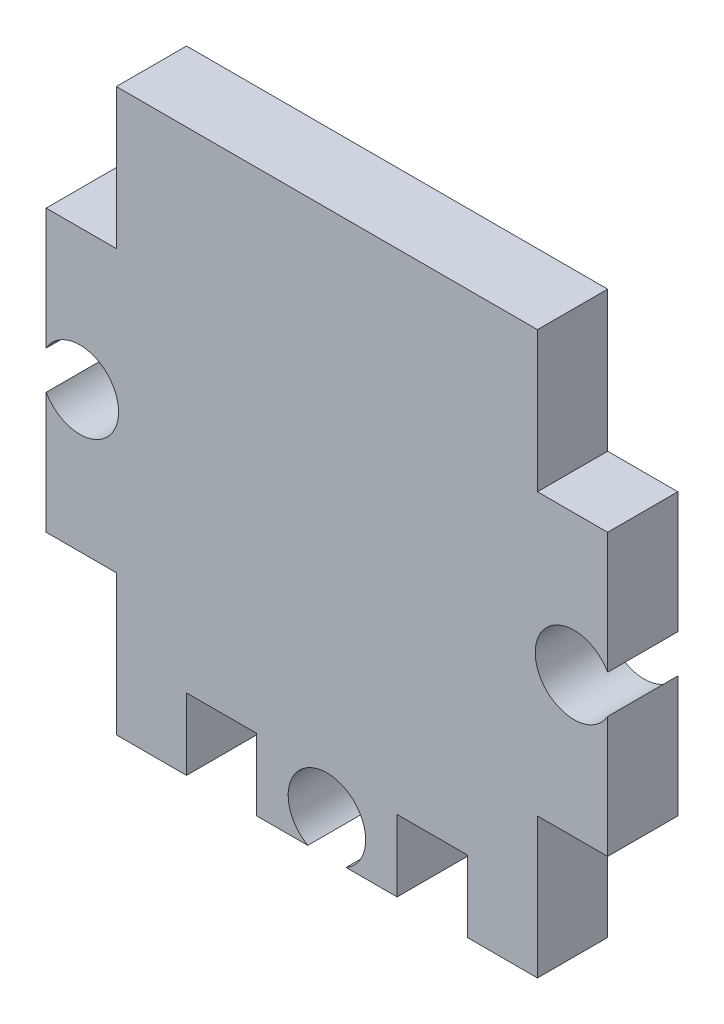
ISO-10303-21;
HEADER;
FILE_DESCRIPTION(('STEP AP214'),'2;1');
FILE_NAME('part.step','',(''),(''),'','','');
FILE_SCHEMA(('AUTOMOTIVE_DESIGN { 1 0 10303 214 1 1 1 1 }'));
ENDSEC;
DATA;
#1=APPLICATION_CONTEXT('core data for automotive mechanical design processes');
#2=APPLICATION_PROTOCOL_DEFINITION('international standard','automotive_design',2000,#1);
#3=PRODUCT_CONTEXT('',#1,'mechanical');
#4=PRODUCT('Part','Part','',(#3));
#5=PRODUCT_RELATED_PRODUCT_CATEGORY('part','',(#4));
#6=PRODUCT_DEFINITION_FORMATION('','',#4);
#7=PRODUCT_DEFINITION_CONTEXT('part definition',#1,'design');
#8=PRODUCT_DEFINITION('design','',#6,#7);
#9=PRODUCT_DEFINITION_SHAPE('','',#8);
#10=(LENGTH_UNIT() NAMED_UNIT(*) SI_UNIT(.MILLI.,.METRE.));
#11=(NAMED_UNIT(*) PLANE_ANGLE_UNIT() SI_UNIT($,.RADIAN.));
#12=(NAMED_UNIT(*) SI_UNIT($,.STERADIAN.) SOLID_ANGLE_UNIT());
#13=UNCERTAINTY_MEASURE_WITH_UNIT(LENGTH_MEASURE(1.E-05),#10,'distance_accuracy_value','');
#14=(GEOMETRIC_REPRESENTATION_CONTEXT(3) GLOBAL_UNCERTAINTY_ASSIGNED_CONTEXT((#13)) GLOBAL_UNIT_ASSIGNED_CONTEXT((#10,
#11,#12)) REPRESENTATION_CONTEXT('',''));
#15=CARTESIAN_POINT('',(0.,0.,0.));
#16=DIRECTION('',(0.,0.,1.));
#17=DIRECTION('',(1.,0.,0.));
#18=AXIS2_PLACEMENT_3D('',#15,#16,#17);
#19=CARTESIAN_POINT('',(-12.7,-6.35,3.175));
#20=DIRECTION('',(0.,1.,0.));
#21=DIRECTION('',(-1.,0.,0.));
#22=AXIS2_PLACEMENT_3D('',#19,#20,#21);
#23=PLANE('',#22);
#24=DIRECTION('',(1.,0.,0.));
#25=VECTOR('',#24,1.);
#26=CARTESIAN_POINT('',(-12.7,-6.35,0.));
#27=LINE('',#26,#25);
#28=CARTESIAN_POINT('',(-12.7,-6.35,0.));
#29=VERTEX_POINT('',#28);
#30=CARTESIAN_POINT('',(-9.525,-6.35,0.));
#31=VERTEX_POINT('',#30);
#32=EDGE_CURVE('E237',#29,#31,#27,.T.);
#33=ORIENTED_EDGE('',*,*,#32,.T.);
#34=DIRECTION('',(0.,0.,-1.));
#35=VECTOR('',#34,1.);
#36=CARTESIAN_POINT('',(-9.525,-6.35,3.175));
#37=LINE('',#36,#35);
#38=CARTESIAN_POINT('',(-9.525,-6.35,3.175));
#39=VERTEX_POINT('',#38);
#40=EDGE_CURVE('E11',#39,#31,#37,.T.);
#41=ORIENTED_EDGE('',*,*,#40,.F.);
#42=DIRECTION('',(1.,0.,0.));
#43=VECTOR('',#42,1.);
#44=CARTESIAN_POINT('',(-12.7,-6.35,3.175));
#45=LINE('',#44,#43);
#46=CARTESIAN_POINT('',(-12.7,-6.35,3.175));
#47=VERTEX_POINT('',#46);
#48=EDGE_CURVE('E287',#47,#39,#45,.T.);
#49=ORIENTED_EDGE('',*,*,#48,.F.);
#50=DIRECTION('',(0.,0.,-1.));
#51=VECTOR('',#50,1.);
#52=CARTESIAN_POINT('',(-12.7,-6.35,3.175));
#53=LINE('',#52,#51);
#54=EDGE_CURVE('E233',#47,#29,#53,.T.);
#55=ORIENTED_EDGE('',*,*,#54,.T.);
#56=EDGE_LOOP('',(#33,#41,#49,#55));
#57=FACE_BOUND('',#56,.T.);
#58=ADVANCED_FACE('F33',(#57),#23,.F.);
#59=CARTESIAN_POINT('',(-9.525,-6.35,3.175));
#60=DIRECTION('',(1.,0.,0.));
#61=DIRECTION('',(0.,0.,-1.));
#62=AXIS2_PLACEMENT_3D('',#59,#60,#61);
#63=PLANE('',#62);
#64=DIRECTION('',(0.,-1.,0.));
#65=VECTOR('',#64,1.);
#66=CARTESIAN_POINT('',(-9.525,-6.35,0.));
#67=LINE('',#66,#65);
#68=CARTESIAN_POINT('',(-9.525,-12.7,0.));
#69=VERTEX_POINT('',#68);
#70=EDGE_CURVE('E240',#31,#69,#67,.T.);
#71=ORIENTED_EDGE('',*,*,#70,.T.);
#72=DIRECTION('',(0.,0.,-1.));
#73=VECTOR('',#72,1.);
#74=CARTESIAN_POINT('',(-9.525,-12.7,3.175));
#75=LINE('',#74,#73);
#76=CARTESIAN_POINT('',(-9.525,-12.7,3.175));
#77=VERTEX_POINT('',#76);
#78=EDGE_CURVE('E41',#77,#69,#75,.T.);
#79=ORIENTED_EDGE('',*,*,#78,.F.);
#80=DIRECTION('',(0.,-1.,0.));
#81=VECTOR('',#80,1.);
#82=CARTESIAN_POINT('',(-9.525,-6.35,3.175));
#83=LINE('',#82,#81);
#84=EDGE_CURVE('E146',#39,#77,#83,.T.);
#85=ORIENTED_EDGE('',*,*,#84,.F.);
#86=ORIENTED_EDGE('',*,*,#40,.T.);
#87=EDGE_LOOP('',(#71,#79,#85,#86));
#88=FACE_BOUND('',#87,.T.);
#89=ADVANCED_FACE('F435',(#88),#63,.F.);
#90=CARTESIAN_POINT('',(-9.525,-12.7,3.175));
#91=DIRECTION('',(0.,1.,0.));
#92=DIRECTION('',(0.,0.,1.));
#93=AXIS2_PLACEMENT_3D('',#90,#91,#92);
#94=PLANE('',#93);
#95=DIRECTION('',(1.,0.,0.));
#96=VECTOR('',#95,1.);
#97=CARTESIAN_POINT('',(-9.525,-12.7,0.));
#98=LINE('',#97,#96);
#99=CARTESIAN_POINT('',(-6.35,-12.7,0.));
#100=VERTEX_POINT('',#99);
#101=EDGE_CURVE('E242',#69,#100,#98,.T.);
#102=ORIENTED_EDGE('',*,*,#101,.T.);
#103=DIRECTION('',(0.,0.,-1.));
#104=VECTOR('',#103,1.);
#105=CARTESIAN_POINT('',(-6.35,-12.7,3.175));
#106=LINE('',#105,#104);
#107=CARTESIAN_POINT('',(-6.35,-12.7,3.175));
#108=VERTEX_POINT('',#107);
#109=EDGE_CURVE('E348',#108,#100,#106,.T.);
#110=ORIENTED_EDGE('',*,*,#109,.F.);
#111=DIRECTION('',(1.,0.,0.));
#112=VECTOR('',#111,1.);
#113=CARTESIAN_POINT('',(-9.525,-12.7,3.175));
#114=LINE('',#113,#112);
#115=EDGE_CURVE('E356',#77,#108,#114,.T.);
#116=ORIENTED_EDGE('',*,*,#115,.F.);
#117=ORIENTED_EDGE('',*,*,#78,.T.);
#118=EDGE_LOOP('',(#102,#110,#116,#117));
#119=FACE_BOUND('',#118,.T.);
#120=ADVANCED_FACE('F354',(#119),#94,.F.);
#121=CARTESIAN_POINT('',(-6.35,-9.46709374294294,3.175));
#122=DIRECTION('',(-1.,0.,0.));
#123=DIRECTION('',(0.,0.,1.));
#124=AXIS2_PLACEMENT_3D('',#121,#122,#123);
#125=PLANE('',#124);
#126=DIRECTION('',(0.,1.,0.));
#127=VECTOR('',#126,1.);
#128=CARTESIAN_POINT('',(-6.35,-9.46709374294294,0.));
#129=LINE('',#128,#127);
#130=CARTESIAN_POINT('',(-6.35,-9.46709374294294,0.));
#131=VERTEX_POINT('',#130);
#132=EDGE_CURVE('E244',#100,#131,#129,.T.);
#133=ORIENTED_EDGE('',*,*,#132,.T.);
#134=DIRECTION('',(0.,0.,-1.));
#135=VECTOR('',#134,1.);
#136=CARTESIAN_POINT('',(-6.35,-9.46709374294294,3.175));
#137=LINE('',#136,#135);
#138=CARTESIAN_POINT('',(-6.35,-9.46709374294294,3.175));
#139=VERTEX_POINT('',#138);
#140=EDGE_CURVE('E345',#139,#131,#137,.T.);
#141=ORIENTED_EDGE('',*,*,#140,.F.);
#142=DIRECTION('',(0.,1.,0.));
#143=VECTOR('',#142,1.);
#144=CARTESIAN_POINT('',(-6.35,-9.46709374294294,3.175));
#145=LINE('',#144,#143);
#146=EDGE_CURVE('E374',#108,#139,#145,.T.);
#147=ORIENTED_EDGE('',*,*,#146,.F.);
#148=ORIENTED_EDGE('',*,*,#109,.T.);
#149=EDGE_LOOP('',(#133,#141,#147,#148));
#150=FACE_BOUND('',#149,.T.);
#151=ADVANCED_FACE('F365',(#150),#125,.F.);
#152=CARTESIAN_POINT('',(-3.175,-9.46709374294294,3.175));
#153=DIRECTION('',(0.,1.,0.));
#154=DIRECTION('',(0.,0.,1.));
#155=AXIS2_PLACEMENT_3D('',#152,#153,#154);
#156=PLANE('',#155);
#157=DIRECTION('',(1.,0.,0.));
#158=VECTOR('',#157,1.);
#159=CARTESIAN_POINT('',(-3.175,-9.46709374294294,0.));
#160=LINE('',#159,#158);
#161=CARTESIAN_POINT('',(-3.175,-9.46709374294294,0.));
#162=VERTEX_POINT('',#161);
#163=EDGE_CURVE('E246',#131,#162,#160,.T.);
#164=ORIENTED_EDGE('',*,*,#163,.T.);
#165=DIRECTION('',(0.,0.,-1.));
#166=VECTOR('',#165,1.);
#167=CARTESIAN_POINT('',(-3.175,-9.46709374294294,3.175));
#168=LINE('',#167,#166);
#169=CARTESIAN_POINT('',(-3.175,-9.46709374294294,3.175));
#170=VERTEX_POINT('',#169);
#171=EDGE_CURVE('E342',#170,#162,#168,.T.);
#172=ORIENTED_EDGE('',*,*,#171,.F.);
#173=DIRECTION('',(1.,0.,0.));
#174=VECTOR('',#173,1.);
#175=CARTESIAN_POINT('',(-3.175,-9.46709374294294,3.175));
#176=LINE('',#175,#174);
#177=EDGE_CURVE('E371',#139,#170,#176,.T.);
#178=ORIENTED_EDGE('',*,*,#177,.F.);
#179=ORIENTED_EDGE('',*,*,#140,.T.);
#180=EDGE_LOOP('',(#164,#172,#178,#179));
#181=FACE_BOUND('',#180,.T.);
#182=ADVANCED_FACE('F369',(#181),#156,.F.);
#183=CARTESIAN_POINT('',(-3.175,-12.7,3.175));
#184=DIRECTION('',(1.,0.,0.));
#185=DIRECTION('',(0.,0.,-1.));
#186=AXIS2_PLACEMENT_3D('',#183,#184,#185);
#187=PLANE('',#186);
#188=DIRECTION('',(0.,-1.,0.));
#189=VECTOR('',#188,1.);
#190=CARTESIAN_POINT('',(-3.175,-12.7,0.));
#191=LINE('',#190,#189);
#192=CARTESIAN_POINT('',(-3.175,-12.7,0.));
#193=VERTEX_POINT('',#192);
#194=EDGE_CURVE('E248',#162,#193,#191,.T.);
#195=ORIENTED_EDGE('',*,*,#194,.T.);
#196=DIRECTION('',(0.,0.,-1.));
#197=VECTOR('',#196,1.);
#198=CARTESIAN_POINT('',(-3.175,-12.7,3.175));
#199=LINE('',#198,#197);
#200=CARTESIAN_POINT('',(-3.175,-12.7,3.175));
#201=VERTEX_POINT('',#200);
#202=EDGE_CURVE('E339',#201,#193,#199,.T.);
#203=ORIENTED_EDGE('',*,*,#202,.F.);
#204=DIRECTION('',(0.,-1.,0.));
#205=VECTOR('',#204,1.);
#206=CARTESIAN_POINT('',(-3.175,-12.7,3.175));
#207=LINE('',#206,#205);
#208=EDGE_CURVE('E373',#170,#201,#207,.T.);
#209=ORIENTED_EDGE('',*,*,#208,.F.);
#210=ORIENTED_EDGE('',*,*,#171,.T.);
#211=EDGE_LOOP('',(#195,#203,#209,#210));
#212=FACE_BOUND('',#211,.T.);
#213=ADVANCED_FACE('F448',(#212),#187,.F.);
#214=CARTESIAN_POINT('',(-3.175,-12.7,3.175));
#215=DIRECTION('',(0.,1.,0.));
#216=DIRECTION('',(0.,0.,1.));
#217=AXIS2_PLACEMENT_3D('',#214,#215,#216);
#218=PLANE('',#217);
#219=DIRECTION('',(1.,0.,0.));
#220=VECTOR('',#219,1.);
#221=CARTESIAN_POINT('',(-3.175,-12.7,0.));
#222=LINE('',#221,#220);
#223=CARTESIAN_POINT('',(-0.865465631899962,-12.7,0.));
#224=VERTEX_POINT('',#223);
#225=EDGE_CURVE('E250',#193,#224,#222,.T.);
#226=ORIENTED_EDGE('',*,*,#225,.T.);
#227=DIRECTION('',(0.,0.,-1.));
#228=VECTOR('',#227,1.);
#229=CARTESIAN_POINT('',(-0.865465631899962,-12.7,3.175));
#230=LINE('',#229,#228);
#231=CARTESIAN_POINT('',(-0.865465631899962,-12.7,3.175));
#232=VERTEX_POINT('',#231);
#233=EDGE_CURVE('E336',#232,#224,#230,.T.);
#234=ORIENTED_EDGE('',*,*,#233,.F.);
#235=DIRECTION('',(1.,0.,0.));
#236=VECTOR('',#235,1.);
#237=CARTESIAN_POINT('',(-3.175,-12.7,3.175));
#238=LINE('',#237,#236);
#239=EDGE_CURVE('E376',#201,#232,#238,.T.);
#240=ORIENTED_EDGE('',*,*,#239,.F.);
#241=ORIENTED_EDGE('',*,*,#202,.T.);
#242=EDGE_LOOP('',(#226,#234,#240,#241));
#243=FACE_BOUND('',#242,.T.);
#244=ADVANCED_FACE('F451',(#243),#218,.F.);
#245=CARTESIAN_POINT('',(0.,-11.176,3.175));
#246=DIRECTION('',(0.,0.,-1.));
#247=DIRECTION('',(-1.,0.,0.));
#248=AXIS2_PLACEMENT_3D('',#245,#246,#247);
#249=CYLINDRICAL_SURFACE('',#248,1.7526);
#250=CARTESIAN_POINT('',(0.,-11.176,0.));
#251=DIRECTION('',(0.,0.,-1.));
#252=DIRECTION('',(1.,0.,0.));
#253=AXIS2_PLACEMENT_3D('',#250,#251,#252);
#254=CIRCLE('',#253,1.7526);
#255=CARTESIAN_POINT('',(0.865465631899965,-12.7,0.));
#256=VERTEX_POINT('',#255);
#257=EDGE_CURVE('E252',#224,#256,#254,.T.);
#258=ORIENTED_EDGE('',*,*,#257,.T.);
#259=DIRECTION('',(0.,0.,-1.));
#260=VECTOR('',#259,1.);
#261=CARTESIAN_POINT('',(0.865465631899965,-12.7,3.175));
#262=LINE('',#261,#260);
#263=CARTESIAN_POINT('',(0.865465631899965,-12.7,3.175));
#264=VERTEX_POINT('',#263);
#265=EDGE_CURVE('E333',#264,#256,#262,.T.);
#266=ORIENTED_EDGE('',*,*,#265,.F.);
#267=CARTESIAN_POINT('',(0.,-11.176,3.175));
#268=DIRECTION('',(0.,0.,-1.));
#269=DIRECTION('',(1.,0.,0.));
#270=AXIS2_PLACEMENT_3D('',#267,#268,#269);
#271=CIRCLE('',#270,1.7526);
#272=EDGE_CURVE('E382',#232,#264,#271,.T.);
#273=ORIENTED_EDGE('',*,*,#272,.F.);
#274=ORIENTED_EDGE('',*,*,#233,.T.);
#275=EDGE_LOOP('',(#258,#266,#273,#274));
#276=FACE_BOUND('',#275,.T.);
#277=ADVANCED_FACE('F455',(#276),#249,.F.);
#278=CARTESIAN_POINT('',(0.865465631899965,-12.7,3.175));
#279=DIRECTION('',(0.,1.,0.));
#280=DIRECTION('',(0.,0.,1.));
#281=AXIS2_PLACEMENT_3D('',#278,#279,#280);
#282=PLANE('',#281);
#283=DIRECTION('',(1.,0.,0.));
#284=VECTOR('',#283,1.);
#285=CARTESIAN_POINT('',(0.865465631899965,-12.7,0.));
#286=LINE('',#285,#284);
#287=CARTESIAN_POINT('',(3.175,-12.7,0.));
#288=VERTEX_POINT('',#287);
#289=EDGE_CURVE('E254',#256,#288,#286,.T.);
#290=ORIENTED_EDGE('',*,*,#289,.T.);
#291=DIRECTION('',(0.,0.,-1.));
#292=VECTOR('',#291,1.);
#293=CARTESIAN_POINT('',(3.175,-12.7,3.175));
#294=LINE('',#293,#292);
#295=CARTESIAN_POINT('',(3.175,-12.7,3.175));
#296=VERTEX_POINT('',#295);
#297=EDGE_CURVE('E330',#296,#288,#294,.T.);
#298=ORIENTED_EDGE('',*,*,#297,.F.);
#299=DIRECTION('',(1.,0.,0.));
#300=VECTOR('',#299,1.);
#301=CARTESIAN_POINT('',(0.865465631899965,-12.7,3.175));
#302=LINE('',#301,#300);
#303=EDGE_CURVE('E384',#264,#296,#302,.T.);
#304=ORIENTED_EDGE('',*,*,#303,.F.);
#305=ORIENTED_EDGE('',*,*,#265,.T.);
#306=EDGE_LOOP('',(#290,#298,#304,#305));
#307=FACE_BOUND('',#306,.T.);
#308=ADVANCED_FACE('F459',(#307),#282,.F.);
#309=CARTESIAN_POINT('',(3.175,-12.7,3.175));
#310=DIRECTION('',(-1.,0.,0.));
#311=DIRECTION('',(0.,0.,1.));
#312=AXIS2_PLACEMENT_3D('',#309,#310,#311);
#313=PLANE('',#312);
#314=DIRECTION('',(0.,1.,0.));
#315=VECTOR('',#314,1.);
#316=CARTESIAN_POINT('',(3.175,-12.7,0.));
#317=LINE('',#316,#315);
#318=CARTESIAN_POINT('',(3.175,-9.46709374294294,0.));
#319=VERTEX_POINT('',#318);
#320=EDGE_CURVE('E256',#288,#319,#317,.T.);
#321=ORIENTED_EDGE('',*,*,#320,.T.);
#322=DIRECTION('',(0.,0.,-1.));
#323=VECTOR('',#322,1.);
#324=CARTESIAN_POINT('',(3.175,-9.46709374294294,3.175));
#325=LINE('',#324,#323);
#326=CARTESIAN_POINT('',(3.175,-9.46709374294294,3.175));
#327=VERTEX_POINT('',#326);
#328=EDGE_CURVE('E327',#327,#319,#325,.T.);
#329=ORIENTED_EDGE('',*,*,#328,.F.);
#330=DIRECTION('',(0.,1.,0.));
#331=VECTOR('',#330,1.);
#332=CARTESIAN_POINT('',(3.175,-12.7,3.175));
#333=LINE('',#332,#331);
#334=EDGE_CURVE('E386',#296,#327,#333,.T.);
#335=ORIENTED_EDGE('',*,*,#334,.F.);
#336=ORIENTED_EDGE('',*,*,#297,.T.);
#337=EDGE_LOOP('',(#321,#329,#335,#336));
#338=FACE_BOUND('',#337,.T.);
#339=ADVANCED_FACE('F463',(#338),#313,.F.);
#340=CARTESIAN_POINT('',(3.175,-9.46709374294294,3.175));
#341=DIRECTION('',(0.,1.,0.));
#342=DIRECTION('',(0.,0.,1.));
#343=AXIS2_PLACEMENT_3D('',#340,#341,#342);
#344=PLANE('',#343);
#345=DIRECTION('',(1.,0.,0.));
#346=VECTOR('',#345,1.);
#347=CARTESIAN_POINT('',(3.175,-9.46709374294294,0.));
#348=LINE('',#347,#346);
#349=CARTESIAN_POINT('',(6.35,-9.46709374294294,0.));
#350=VERTEX_POINT('',#349);
#351=EDGE_CURVE('E258',#319,#350,#348,.T.);
#352=ORIENTED_EDGE('',*,*,#351,.T.);
#353=DIRECTION('',(0.,0.,-1.));
#354=VECTOR('',#353,1.);
#355=CARTESIAN_POINT('',(6.35,-9.46709374294294,3.175));
#356=LINE('',#355,#354);
#357=CARTESIAN_POINT('',(6.35,-9.46709374294294,3.175));
#358=VERTEX_POINT('',#357);
#359=EDGE_CURVE('E324',#358,#350,#356,.T.);
#360=ORIENTED_EDGE('',*,*,#359,.F.);
#361=DIRECTION('',(1.,0.,0.));
#362=VECTOR('',#361,1.);
#363=CARTESIAN_POINT('',(3.175,-9.46709374294294,3.175));
#364=LINE('',#363,#362);
#365=EDGE_CURVE('E388',#327,#358,#364,.T.);
#366=ORIENTED_EDGE('',*,*,#365,.F.);
#367=ORIENTED_EDGE('',*,*,#328,.T.);
#368=EDGE_LOOP('',(#352,#360,#366,#367));
#369=FACE_BOUND('',#368,.T.);
#370=ADVANCED_FACE('F467',(#369),#344,.F.);
#371=CARTESIAN_POINT('',(6.35,-9.46709374294294,3.175));
#372=DIRECTION('',(1.,0.,0.));
#373=DIRECTION('',(0.,0.,-1.));
#374=AXIS2_PLACEMENT_3D('',#371,#372,#373);
#375=PLANE('',#374);
#376=DIRECTION('',(0.,-1.,0.));
#377=VECTOR('',#376,1.);
#378=CARTESIAN_POINT('',(6.35,-9.46709374294294,0.));
#379=LINE('',#378,#377);
#380=CARTESIAN_POINT('',(6.35,-12.7,0.));
#381=VERTEX_POINT('',#380);
#382=EDGE_CURVE('E260',#350,#381,#379,.T.);
#383=ORIENTED_EDGE('',*,*,#382,.T.);
#384=DIRECTION('',(0.,0.,-1.));
#385=VECTOR('',#384,1.);
#386=CARTESIAN_POINT('',(6.35,-12.7,3.175));
#387=LINE('',#386,#385);
#388=CARTESIAN_POINT('',(6.35,-12.7,3.175));
#389=VERTEX_POINT('',#388);
#390=EDGE_CURVE('E321',#389,#381,#387,.T.);
#391=ORIENTED_EDGE('',*,*,#390,.F.);
#392=DIRECTION('',(0.,-1.,0.));
#393=VECTOR('',#392,1.);
#394=CARTESIAN_POINT('',(6.35,-9.46709374294294,3.175));
#395=LINE('',#394,#393);
#396=EDGE_CURVE('E390',#358,#389,#395,.T.);
#397=ORIENTED_EDGE('',*,*,#396,.F.);
#398=ORIENTED_EDGE('',*,*,#359,.T.);
#399=EDGE_LOOP('',(#383,#391,#397,#398));
#400=FACE_BOUND('',#399,.T.);
#401=ADVANCED_FACE('F471',(#400),#375,.F.);
#402=CARTESIAN_POINT('',(6.35,-12.7,3.175));
#403=DIRECTION('',(0.,1.,0.));
#404=DIRECTION('',(0.,0.,1.));
#405=AXIS2_PLACEMENT_3D('',#402,#403,#404);
#406=PLANE('',#405);
#407=DIRECTION('',(1.,0.,0.));
#408=VECTOR('',#407,1.);
#409=CARTESIAN_POINT('',(6.35,-12.7,0.));
#410=LINE('',#409,#408);
#411=CARTESIAN_POINT('',(9.525,-12.7,0.));
#412=VERTEX_POINT('',#411);
#413=EDGE_CURVE('E262',#381,#412,#410,.T.);
#414=ORIENTED_EDGE('',*,*,#413,.T.);
#415=DIRECTION('',(0.,0.,-1.));
#416=VECTOR('',#415,1.);
#417=CARTESIAN_POINT('',(9.525,-12.7,3.175));
#418=LINE('',#417,#416);
#419=CARTESIAN_POINT('',(9.525,-12.7,3.175));
#420=VERTEX_POINT('',#419);
#421=EDGE_CURVE('E318',#420,#412,#418,.T.);
#422=ORIENTED_EDGE('',*,*,#421,.F.);
#423=DIRECTION('',(1.,0.,0.));
#424=VECTOR('',#423,1.);
#425=CARTESIAN_POINT('',(6.35,-12.7,3.175));
#426=LINE('',#425,#424);
#427=EDGE_CURVE('E392',#389,#420,#426,.T.);
#428=ORIENTED_EDGE('',*,*,#427,.F.);
#429=ORIENTED_EDGE('',*,*,#390,.T.);
#430=EDGE_LOOP('',(#414,#422,#428,#429));
#431=FACE_BOUND('',#430,.T.);
#432=ADVANCED_FACE('F475',(#431),#406,.F.);
#433=CARTESIAN_POINT('',(9.525,-6.35,3.175));
#434=DIRECTION('',(-1.,0.,0.));
#435=DIRECTION('',(0.,0.,1.));
#436=AXIS2_PLACEMENT_3D('',#433,#434,#435);
#437=PLANE('',#436);
#438=DIRECTION('',(0.,1.,0.));
#439=VECTOR('',#438,1.);
#440=CARTESIAN_POINT('',(9.525,-6.35,0.));
#441=LINE('',#440,#439);
#442=CARTESIAN_POINT('',(9.525,-6.35,0.));
#443=VERTEX_POINT('',#442);
#444=EDGE_CURVE('E264',#412,#443,#441,.T.);
#445=ORIENTED_EDGE('',*,*,#444,.T.);
#446=DIRECTION('',(0.,0.,-1.));
#447=VECTOR('',#446,1.);
#448=CARTESIAN_POINT('',(9.525,-6.35,3.175));
#449=LINE('',#448,#447);
#450=CARTESIAN_POINT('',(9.525,-6.35,3.175));
#451=VERTEX_POINT('',#450);
#452=EDGE_CURVE('E315',#451,#443,#449,.T.);
#453=ORIENTED_EDGE('',*,*,#452,.F.);
#454=DIRECTION('',(0.,1.,0.));
#455=VECTOR('',#454,1.);
#456=CARTESIAN_POINT('',(9.525,-6.35,3.175));
#457=LINE('',#456,#455);
#458=EDGE_CURVE('E394',#420,#451,#457,.T.);
#459=ORIENTED_EDGE('',*,*,#458,.F.);
#460=ORIENTED_EDGE('',*,*,#421,.T.);
#461=EDGE_LOOP('',(#445,#453,#459,#460));
#462=FACE_BOUND('',#461,.T.);
#463=ADVANCED_FACE('F479',(#462),#437,.F.);
#464=CARTESIAN_POINT('',(12.7,-6.35,3.175));
#465=DIRECTION('',(0.,1.,0.));
#466=DIRECTION('',(-1.,0.,0.));
#467=AXIS2_PLACEMENT_3D('',#464,#465,#466);
#468=PLANE('',#467);
#469=DIRECTION('',(1.,0.,0.));
#470=VECTOR('',#469,1.);
#471=CARTESIAN_POINT('',(12.7,-6.35,0.));
#472=LINE('',#471,#470);
#473=CARTESIAN_POINT('',(12.7,-6.35,0.));
#474=VERTEX_POINT('',#473);
#475=EDGE_CURVE('E266',#443,#474,#472,.T.);
#476=ORIENTED_EDGE('',*,*,#475,.T.);
#477=DIRECTION('',(0.,0.,-1.));
#478=VECTOR('',#477,1.);
#479=CARTESIAN_POINT('',(12.7,-6.35,3.175));
#480=LINE('',#479,#478);
#481=CARTESIAN_POINT('',(12.7,-6.35,3.175));
#482=VERTEX_POINT('',#481);
#483=EDGE_CURVE('E312',#482,#474,#480,.T.);
#484=ORIENTED_EDGE('',*,*,#483,.F.);
#485=DIRECTION('',(1.,0.,0.));
#486=VECTOR('',#485,1.);
#487=CARTESIAN_POINT('',(12.7,-6.35,3.175));
#488=LINE('',#487,#486);
#489=EDGE_CURVE('E396',#451,#482,#488,.T.);
#490=ORIENTED_EDGE('',*,*,#489,.F.);
#491=ORIENTED_EDGE('',*,*,#452,.T.);
#492=EDGE_LOOP('',(#476,#484,#490,#491));
#493=FACE_BOUND('',#492,.T.);
#494=ADVANCED_FACE('F483',(#493),#468,.F.);
#495=CARTESIAN_POINT('',(12.7,-0.86546563189997,3.175));
#496=DIRECTION('',(-1.,0.,0.));
#497=DIRECTION('',(0.,-1.,0.));
#498=AXIS2_PLACEMENT_3D('',#495,#496,#497);
#499=PLANE('',#498);
#500=DIRECTION('',(0.,1.,0.));
#501=VECTOR('',#500,1.);
#502=CARTESIAN_POINT('',(12.7,-0.86546563189997,0.));
#503=LINE('',#502,#501);
#504=CARTESIAN_POINT('',(12.7,-0.86546563189997,0.));
#505=VERTEX_POINT('',#504);
#506=EDGE_CURVE('E268',#474,#505,#503,.T.);
#507=ORIENTED_EDGE('',*,*,#506,.T.);
#508=DIRECTION('',(0.,0.,-1.));
#509=VECTOR('',#508,1.);
#510=CARTESIAN_POINT('',(12.7,-0.86546563189997,3.175));
#511=LINE('',#510,#509);
#512=CARTESIAN_POINT('',(12.7,-0.86546563189997,3.175));
#513=VERTEX_POINT('',#512);
#514=EDGE_CURVE('E309',#513,#505,#511,.T.);
#515=ORIENTED_EDGE('',*,*,#514,.F.);
#516=DIRECTION('',(0.,1.,0.));
#517=VECTOR('',#516,1.);
#518=CARTESIAN_POINT('',(12.7,-0.86546563189997,3.175));
#519=LINE('',#518,#517);
#520=EDGE_CURVE('E398',#482,#513,#519,.T.);
#521=ORIENTED_EDGE('',*,*,#520,.F.);
#522=ORIENTED_EDGE('',*,*,#483,.T.);
#523=EDGE_LOOP('',(#507,#515,#521,#522));
#524=FACE_BOUND('',#523,.T.);
#525=ADVANCED_FACE('F487',(#524),#499,.F.);
#526=CARTESIAN_POINT('',(11.176,0.,3.175));
#527=DIRECTION('',(0.,0.,-1.));
#528=DIRECTION('',(-1.,0.,0.));
#529=AXIS2_PLACEMENT_3D('',#526,#527,#528);
#530=CYLINDRICAL_SURFACE('',#529,1.7526);
#531=CARTESIAN_POINT('',(11.176,0.,0.));
#532=DIRECTION('',(0.,0.,-1.));
#533=DIRECTION('',(-1.,0.,0.));
#534=AXIS2_PLACEMENT_3D('',#531,#532,#533);
#535=CIRCLE('',#534,1.7526);
#536=CARTESIAN_POINT('',(12.7,0.865465631899969,0.));
#537=VERTEX_POINT('',#536);
#538=EDGE_CURVE('E270',#505,#537,#535,.T.);
#539=ORIENTED_EDGE('',*,*,#538,.T.);
#540=DIRECTION('',(0.,0.,-1.));
#541=VECTOR('',#540,1.);
#542=CARTESIAN_POINT('',(12.7,0.865465631899969,3.175));
#543=LINE('',#542,#541);
#544=CARTESIAN_POINT('',(12.7,0.865465631899969,3.175));
#545=VERTEX_POINT('',#544);
#546=EDGE_CURVE('E306',#545,#537,#543,.T.);
#547=ORIENTED_EDGE('',*,*,#546,.F.);
#548=CARTESIAN_POINT('',(11.176,0.,3.175));
#549=DIRECTION('',(0.,0.,-1.));
#550=DIRECTION('',(-1.,0.,0.));
#551=AXIS2_PLACEMENT_3D('',#548,#549,#550);
#552=CIRCLE('',#551,1.7526);
#553=EDGE_CURVE('E400',#513,#545,#552,.T.);
#554=ORIENTED_EDGE('',*,*,#553,.F.);
#555=ORIENTED_EDGE('',*,*,#514,.T.);
#556=EDGE_LOOP('',(#539,#547,#554,#555));
#557=FACE_BOUND('',#556,.T.);
#558=ADVANCED_FACE('F491',(#557),#530,.F.);
#559=CARTESIAN_POINT('',(12.7,6.35,3.175));
#560=DIRECTION('',(-1.,0.,0.));
#561=DIRECTION('',(0.,-1.,0.));
#562=AXIS2_PLACEMENT_3D('',#559,#560,#561);
#563=PLANE('',#562);
#564=DIRECTION('',(0.,1.,0.));
#565=VECTOR('',#564,1.);
#566=CARTESIAN_POINT('',(12.7,6.35,0.));
#567=LINE('',#566,#565);
#568=CARTESIAN_POINT('',(12.7,6.35,0.));
#569=VERTEX_POINT('',#568);
#570=EDGE_CURVE('E272',#537,#569,#567,.T.);
#571=ORIENTED_EDGE('',*,*,#570,.T.);
#572=DIRECTION('',(0.,0.,-1.));
#573=VECTOR('',#572,1.);
#574=CARTESIAN_POINT('',(12.7,6.35,3.175));
#575=LINE('',#574,#573);
#576=CARTESIAN_POINT('',(12.7,6.35,3.175));
#577=VERTEX_POINT('',#576);
#578=EDGE_CURVE('E303',#577,#569,#575,.T.);
#579=ORIENTED_EDGE('',*,*,#578,.F.);
#580=DIRECTION('',(0.,1.,0.));
#581=VECTOR('',#580,1.);
#582=CARTESIAN_POINT('',(12.7,6.35,3.175));
#583=LINE('',#582,#581);
#584=EDGE_CURVE('E402',#545,#577,#583,.T.);
#585=ORIENTED_EDGE('',*,*,#584,.F.);
#586=ORIENTED_EDGE('',*,*,#546,.T.);
#587=EDGE_LOOP('',(#571,#579,#585,#586));
#588=FACE_BOUND('',#587,.T.);
#589=ADVANCED_FACE('F495',(#588),#563,.F.);
#590=CARTESIAN_POINT('',(12.7,6.35,3.175));
#591=DIRECTION('',(0.,-1.,0.));
#592=DIRECTION('',(1.,0.,0.));
#593=AXIS2_PLACEMENT_3D('',#590,#591,#592);
#594=PLANE('',#593);
#595=DIRECTION('',(-1.,0.,0.));
#596=VECTOR('',#595,1.);
#597=CARTESIAN_POINT('',(12.7,6.35,0.));
#598=LINE('',#597,#596);
#599=CARTESIAN_POINT('',(9.525,6.35,0.));
#600=VERTEX_POINT('',#599);
#601=EDGE_CURVE('E274',#569,#600,#598,.T.);
#602=ORIENTED_EDGE('',*,*,#601,.T.);
#603=DIRECTION('',(0.,0.,-1.));
#604=VECTOR('',#603,1.);
#605=CARTESIAN_POINT('',(9.525,6.35,3.175));
#606=LINE('',#605,#604);
#607=CARTESIAN_POINT('',(9.525,6.35,3.175));
#608=VERTEX_POINT('',#607);
#609=EDGE_CURVE('E300',#608,#600,#606,.T.);
#610=ORIENTED_EDGE('',*,*,#609,.F.);
#611=DIRECTION('',(-1.,0.,0.));
#612=VECTOR('',#611,1.);
#613=CARTESIAN_POINT('',(12.7,6.35,3.175));
#614=LINE('',#613,#612);
#615=EDGE_CURVE('E404',#577,#608,#614,.T.);
#616=ORIENTED_EDGE('',*,*,#615,.F.);
#617=ORIENTED_EDGE('',*,*,#578,.T.);
#618=EDGE_LOOP('',(#602,#610,#616,#617));
#619=FACE_BOUND('',#618,.T.);
#620=ADVANCED_FACE('F499',(#619),#594,.F.);
#621=CARTESIAN_POINT('',(9.525,6.35,3.175));
#622=DIRECTION('',(-1.,0.,0.));
#623=DIRECTION('',(0.,0.,1.));
#624=AXIS2_PLACEMENT_3D('',#621,#622,#623);
#625=PLANE('',#624);
#626=DIRECTION('',(0.,1.,0.));
#627=VECTOR('',#626,1.);
#628=CARTESIAN_POINT('',(9.525,6.35,0.));
#629=LINE('',#628,#627);
#630=CARTESIAN_POINT('',(9.525,12.7,0.));
#631=VERTEX_POINT('',#630);
#632=EDGE_CURVE('E276',#600,#631,#629,.T.);
#633=ORIENTED_EDGE('',*,*,#632,.T.);
#634=DIRECTION('',(0.,0.,-1.));
#635=VECTOR('',#634,1.);
#636=CARTESIAN_POINT('',(9.525,12.7,3.175));
#637=LINE('',#636,#635);
#638=CARTESIAN_POINT('',(9.525,12.7,3.175));
#639=VERTEX_POINT('',#638);
#640=EDGE_CURVE('E297',#639,#631,#637,.T.);
#641=ORIENTED_EDGE('',*,*,#640,.F.);
#642=DIRECTION('',(0.,1.,0.));
#643=VECTOR('',#642,1.);
#644=CARTESIAN_POINT('',(9.525,6.35,3.175));
#645=LINE('',#644,#643);
#646=EDGE_CURVE('E406',#608,#639,#645,.T.);
#647=ORIENTED_EDGE('',*,*,#646,.F.);
#648=ORIENTED_EDGE('',*,*,#609,.T.);
#649=EDGE_LOOP('',(#633,#641,#647,#648));
#650=FACE_BOUND('',#649,.T.);
#651=ADVANCED_FACE('F503',(#650),#625,.F.);
#652=CARTESIAN_POINT('',(-9.525,12.7,3.175));
#653=DIRECTION('',(0.,-1.,0.));
#654=DIRECTION('',(0.,0.,-1.));
#655=AXIS2_PLACEMENT_3D('',#652,#653,#654);
#656=PLANE('',#655);
#657=DIRECTION('',(-1.,0.,0.));
#658=VECTOR('',#657,1.);
#659=CARTESIAN_POINT('',(-9.525,12.7,0.));
#660=LINE('',#659,#658);
#661=CARTESIAN_POINT('',(-9.525,12.7,0.));
#662=VERTEX_POINT('',#661);
#663=EDGE_CURVE('E278',#631,#662,#660,.T.);
#664=ORIENTED_EDGE('',*,*,#663,.T.);
#665=DIRECTION('',(0.,0.,-1.));
#666=VECTOR('',#665,1.);
#667=CARTESIAN_POINT('',(-9.525,12.7,3.175));
#668=LINE('',#667,#666);
#669=CARTESIAN_POINT('',(-9.525,12.7,3.175));
#670=VERTEX_POINT('',#669);
#671=EDGE_CURVE('E294',#670,#662,#668,.T.);
#672=ORIENTED_EDGE('',*,*,#671,.F.);
#673=DIRECTION('',(-1.,0.,0.));
#674=VECTOR('',#673,1.);
#675=CARTESIAN_POINT('',(-9.525,12.7,3.175));
#676=LINE('',#675,#674);
#677=EDGE_CURVE('E408',#639,#670,#676,.T.);
#678=ORIENTED_EDGE('',*,*,#677,.F.);
#679=ORIENTED_EDGE('',*,*,#640,.T.);
#680=EDGE_LOOP('',(#664,#672,#678,#679));
#681=FACE_BOUND('',#680,.T.);
#682=ADVANCED_FACE('F507',(#681),#656,.F.);
#683=CARTESIAN_POINT('',(-9.525,6.35,3.175));
#684=DIRECTION('',(1.,0.,0.));
#685=DIRECTION('',(0.,0.,-1.));
#686=AXIS2_PLACEMENT_3D('',#683,#684,#685);
#687=PLANE('',#686);
#688=DIRECTION('',(0.,-1.,0.));
#689=VECTOR('',#688,1.);
#690=CARTESIAN_POINT('',(-9.525,6.35,0.));
#691=LINE('',#690,#689);
#692=CARTESIAN_POINT('',(-9.525,6.35,0.));
#693=VERTEX_POINT('',#692);
#694=EDGE_CURVE('E280',#662,#693,#691,.T.);
#695=ORIENTED_EDGE('',*,*,#694,.T.);
#696=DIRECTION('',(0.,0.,-1.));
#697=VECTOR('',#696,1.);
#698=CARTESIAN_POINT('',(-9.525,6.35,3.175));
#699=LINE('',#698,#697);
#700=CARTESIAN_POINT('',(-9.525,6.35,3.175));
#701=VERTEX_POINT('',#700);
#702=EDGE_CURVE('E291',#701,#693,#699,.T.);
#703=ORIENTED_EDGE('',*,*,#702,.F.);
#704=DIRECTION('',(0.,-1.,0.));
#705=VECTOR('',#704,1.);
#706=CARTESIAN_POINT('',(-9.525,6.35,3.175));
#707=LINE('',#706,#705);
#708=EDGE_CURVE('E410',#670,#701,#707,.T.);
#709=ORIENTED_EDGE('',*,*,#708,.F.);
#710=ORIENTED_EDGE('',*,*,#671,.T.);
#711=EDGE_LOOP('',(#695,#703,#709,#710));
#712=FACE_BOUND('',#711,.T.);
#713=ADVANCED_FACE('F416',(#712),#687,.F.);
#714=CARTESIAN_POINT('',(-12.7,6.35,3.175));
#715=DIRECTION('',(0.,-1.,0.));
#716=DIRECTION('',(1.,0.,0.));
#717=AXIS2_PLACEMENT_3D('',#714,#715,#716);
#718=PLANE('',#717);
#719=DIRECTION('',(-1.,0.,0.));
#720=VECTOR('',#719,1.);
#721=CARTESIAN_POINT('',(-12.7,6.35,0.));
#722=LINE('',#721,#720);
#723=CARTESIAN_POINT('',(-12.7,6.35,0.));
#724=VERTEX_POINT('',#723);
#725=EDGE_CURVE('E282',#693,#724,#722,.T.);
#726=ORIENTED_EDGE('',*,*,#725,.T.);
#727=DIRECTION('',(0.,0.,-1.));
#728=VECTOR('',#727,1.);
#729=CARTESIAN_POINT('',(-12.7,6.35,3.175));
#730=LINE('',#729,#728);
#731=CARTESIAN_POINT('',(-12.7,6.35,3.175));
#732=VERTEX_POINT('',#731);
#733=EDGE_CURVE('E228',#732,#724,#730,.T.);
#734=ORIENTED_EDGE('',*,*,#733,.F.);
#735=DIRECTION('',(-1.,0.,0.));
#736=VECTOR('',#735,1.);
#737=CARTESIAN_POINT('',(-12.7,6.35,3.175));
#738=LINE('',#737,#736);
#739=EDGE_CURVE('E219',#701,#732,#738,.T.);
#740=ORIENTED_EDGE('',*,*,#739,.F.);
#741=ORIENTED_EDGE('',*,*,#702,.T.);
#742=EDGE_LOOP('',(#726,#734,#740,#741));
#743=FACE_BOUND('',#742,.T.);
#744=ADVANCED_FACE('F420',(#743),#718,.F.);
#745=CARTESIAN_POINT('',(-12.7,6.35,3.175));
#746=DIRECTION('',(1.,0.,0.));
#747=DIRECTION('',(0.,1.,0.));
#748=AXIS2_PLACEMENT_3D('',#745,#746,#747);
#749=PLANE('',#748);
#750=DIRECTION('',(0.,-1.,0.));
#751=VECTOR('',#750,1.);
#752=CARTESIAN_POINT('',(-12.7,6.35,0.));
#753=LINE('',#752,#751);
#754=CARTESIAN_POINT('',(-12.7,0.865465631899969,0.));
#755=VERTEX_POINT('',#754);
#756=EDGE_CURVE('E227',#724,#755,#753,.T.);
#757=ORIENTED_EDGE('',*,*,#756,.T.);
#758=DIRECTION('',(0.,0.,-1.));
#759=VECTOR('',#758,1.);
#760=CARTESIAN_POINT('',(-12.7,0.865465631899969,3.175));
#761=LINE('',#760,#759);
#762=CARTESIAN_POINT('',(-12.7,0.865465631899969,3.175));
#763=VERTEX_POINT('',#762);
#764=EDGE_CURVE('E224',#763,#755,#761,.T.);
#765=ORIENTED_EDGE('',*,*,#764,.F.);
#766=DIRECTION('',(0.,-1.,0.));
#767=VECTOR('',#766,1.);
#768=CARTESIAN_POINT('',(-12.7,6.35,3.175));
#769=LINE('',#768,#767);
#770=EDGE_CURVE('E213',#732,#763,#769,.T.);
#771=ORIENTED_EDGE('',*,*,#770,.F.);
#772=ORIENTED_EDGE('',*,*,#733,.T.);
#773=EDGE_LOOP('',(#757,#765,#771,#772));
#774=FACE_BOUND('',#773,.T.);
#775=ADVANCED_FACE('F225',(#774),#749,.F.);
#776=CARTESIAN_POINT('',(-11.176,0.,3.175));
#777=DIRECTION('',(0.,0.,-1.));
#778=DIRECTION('',(-1.,0.,0.));
#779=AXIS2_PLACEMENT_3D('',#776,#777,#778);
#780=CYLINDRICAL_SURFACE('',#779,1.7526);
#781=CARTESIAN_POINT('',(-11.176,0.,0.));
#782=DIRECTION('',(0.,0.,-1.));
#783=DIRECTION('',(1.,0.,0.));
#784=AXIS2_PLACEMENT_3D('',#781,#782,#783);
#785=CIRCLE('',#784,1.7526);
#786=CARTESIAN_POINT('',(-12.7,-0.86546563189997,0.));
#787=VERTEX_POINT('',#786);
#788=EDGE_CURVE('E132',#755,#787,#785,.T.);
#789=ORIENTED_EDGE('',*,*,#788,.T.);
#790=DIRECTION('',(0.,0.,-1.));
#791=VECTOR('',#790,1.);
#792=CARTESIAN_POINT('',(-12.7,-0.86546563189997,3.175));
#793=LINE('',#792,#791);
#794=CARTESIAN_POINT('',(-12.7,-0.86546563189997,3.175));
#795=VERTEX_POINT('',#794);
#796=EDGE_CURVE('E229',#795,#787,#793,.T.);
#797=ORIENTED_EDGE('',*,*,#796,.F.);
#798=CARTESIAN_POINT('',(-11.176,0.,3.175));
#799=DIRECTION('',(0.,0.,-1.));
#800=DIRECTION('',(1.,0.,0.));
#801=AXIS2_PLACEMENT_3D('',#798,#799,#800);
#802=CIRCLE('',#801,1.7526);
#803=EDGE_CURVE('E217',#763,#795,#802,.T.);
#804=ORIENTED_EDGE('',*,*,#803,.F.);
#805=ORIENTED_EDGE('',*,*,#764,.T.);
#806=EDGE_LOOP('',(#789,#797,#804,#805));
#807=FACE_BOUND('',#806,.T.);
#808=ADVANCED_FACE('F231',(#807),#780,.F.);
#809=CARTESIAN_POINT('',(-12.7,-0.86546563189997,3.175));
#810=DIRECTION('',(1.,0.,0.));
#811=DIRECTION('',(0.,1.,0.));
#812=AXIS2_PLACEMENT_3D('',#809,#810,#811);
#813=PLANE('',#812);
#814=DIRECTION('',(0.,-1.,0.));
#815=VECTOR('',#814,1.);
#816=CARTESIAN_POINT('',(-12.7,-0.86546563189997,0.));
#817=LINE('',#816,#815);
#818=EDGE_CURVE('E138',#787,#29,#817,.T.);
#819=ORIENTED_EDGE('',*,*,#818,.T.);
#820=ORIENTED_EDGE('',*,*,#54,.F.);
#821=DIRECTION('',(0.,-1.,0.));
#822=VECTOR('',#821,1.);
#823=CARTESIAN_POINT('',(-12.7,-0.86546563189997,3.175));
#824=LINE('',#823,#822);
#825=EDGE_CURVE('E49',#795,#47,#824,.T.);
#826=ORIENTED_EDGE('',*,*,#825,.F.);
#827=ORIENTED_EDGE('',*,*,#796,.T.);
#828=EDGE_LOOP('',(#819,#820,#826,#827));
#829=FACE_BOUND('',#828,.T.);
#830=ADVANCED_FACE('F424',(#829),#813,.F.);
#831=CARTESIAN_POINT('',(0.,-11.176,3.175));
#832=DIRECTION('',(0.,0.,1.));
#833=DIRECTION('',(1.,0.,0.));
#834=AXIS2_PLACEMENT_3D('',#831,#832,#833);
#835=PLANE('',#834);
#836=ORIENTED_EDGE('',*,*,#48,.T.);
#837=ORIENTED_EDGE('',*,*,#84,.T.);
#838=ORIENTED_EDGE('',*,*,#115,.T.);
#839=ORIENTED_EDGE('',*,*,#146,.T.);
#840=ORIENTED_EDGE('',*,*,#177,.T.);
#841=ORIENTED_EDGE('',*,*,#208,.T.);
#842=ORIENTED_EDGE('',*,*,#239,.T.);
#843=ORIENTED_EDGE('',*,*,#272,.T.);
#844=ORIENTED_EDGE('',*,*,#303,.T.);
#845=ORIENTED_EDGE('',*,*,#334,.T.);
#846=ORIENTED_EDGE('',*,*,#365,.T.);
#847=ORIENTED_EDGE('',*,*,#396,.T.);
#848=ORIENTED_EDGE('',*,*,#427,.T.);
#849=ORIENTED_EDGE('',*,*,#458,.T.);
#850=ORIENTED_EDGE('',*,*,#489,.T.);
#851=ORIENTED_EDGE('',*,*,#520,.T.);
#852=ORIENTED_EDGE('',*,*,#553,.T.);
#853=ORIENTED_EDGE('',*,*,#584,.T.);
#854=ORIENTED_EDGE('',*,*,#615,.T.);
#855=ORIENTED_EDGE('',*,*,#646,.T.);
#856=ORIENTED_EDGE('',*,*,#677,.T.);
#857=ORIENTED_EDGE('',*,*,#708,.T.);
#858=ORIENTED_EDGE('',*,*,#739,.T.);
#859=ORIENTED_EDGE('',*,*,#770,.T.);
#860=ORIENTED_EDGE('',*,*,#803,.T.);
#861=ORIENTED_EDGE('',*,*,#825,.T.);
#862=EDGE_LOOP('',(#836,#837,#838,#839,#840,#841,#842,#843,#844,#845,#846,#847,#848,#849,#850,
#851,#852,#853,#854,#855,#856,#857,#858,#859,#860,#861));
#863=FACE_BOUND('',#862,.T.);
#864=ADVANCED_FACE('F215',(#863),#835,.T.);
#865=CARTESIAN_POINT('',(0.,-11.176,0.));
#866=DIRECTION('',(0.,0.,1.));
#867=DIRECTION('',(1.,0.,0.));
#868=AXIS2_PLACEMENT_3D('',#865,#866,#867);
#869=PLANE('',#868);
#870=ORIENTED_EDGE('',*,*,#32,.F.);
#871=ORIENTED_EDGE('',*,*,#818,.F.);
#872=ORIENTED_EDGE('',*,*,#788,.F.);
#873=ORIENTED_EDGE('',*,*,#756,.F.);
#874=ORIENTED_EDGE('',*,*,#725,.F.);
#875=ORIENTED_EDGE('',*,*,#694,.F.);
#876=ORIENTED_EDGE('',*,*,#663,.F.);
#877=ORIENTED_EDGE('',*,*,#632,.F.);
#878=ORIENTED_EDGE('',*,*,#601,.F.);
#879=ORIENTED_EDGE('',*,*,#570,.F.);
#880=ORIENTED_EDGE('',*,*,#538,.F.);
#881=ORIENTED_EDGE('',*,*,#506,.F.);
#882=ORIENTED_EDGE('',*,*,#475,.F.);
#883=ORIENTED_EDGE('',*,*,#444,.F.);
#884=ORIENTED_EDGE('',*,*,#413,.F.);
#885=ORIENTED_EDGE('',*,*,#382,.F.);
#886=ORIENTED_EDGE('',*,*,#351,.F.);
#887=ORIENTED_EDGE('',*,*,#320,.F.);
#888=ORIENTED_EDGE('',*,*,#289,.F.);
#889=ORIENTED_EDGE('',*,*,#257,.F.);
#890=ORIENTED_EDGE('',*,*,#225,.F.);
#891=ORIENTED_EDGE('',*,*,#194,.F.);
#892=ORIENTED_EDGE('',*,*,#163,.F.);
#893=ORIENTED_EDGE('',*,*,#132,.F.);
#894=ORIENTED_EDGE('',*,*,#101,.F.);
#895=ORIENTED_EDGE('',*,*,#70,.F.);
#896=EDGE_LOOP('',(#870,#871,#872,#873,#874,#875,#876,#877,#878,#879,#880,#881,#882,#883,#884,
#885,#886,#887,#888,#889,#890,#891,#892,#893,#894,#895));
#897=FACE_BOUND('',#896,.T.);
#898=ADVANCED_FACE('F360',(#897),#869,.F.);
#899=CLOSED_SHELL('',(#58,#89,#120,#151,#182,#213,#244,#277,#308,#339,#370,#401,#432,#463,#494,
#525,#558,#589,#620,#651,#682,#713,#744,#775,#808,#830,#864,#898));
#900=MANIFOLD_SOLID_BREP('B2',#899);
#901=ADVANCED_BREP_SHAPE_REPRESENTATION('',(#18,#900),#14);
#902=SHAPE_DEFINITION_REPRESENTATION(#9,#901);
ENDSEC;
END-ISO-10303-21;
